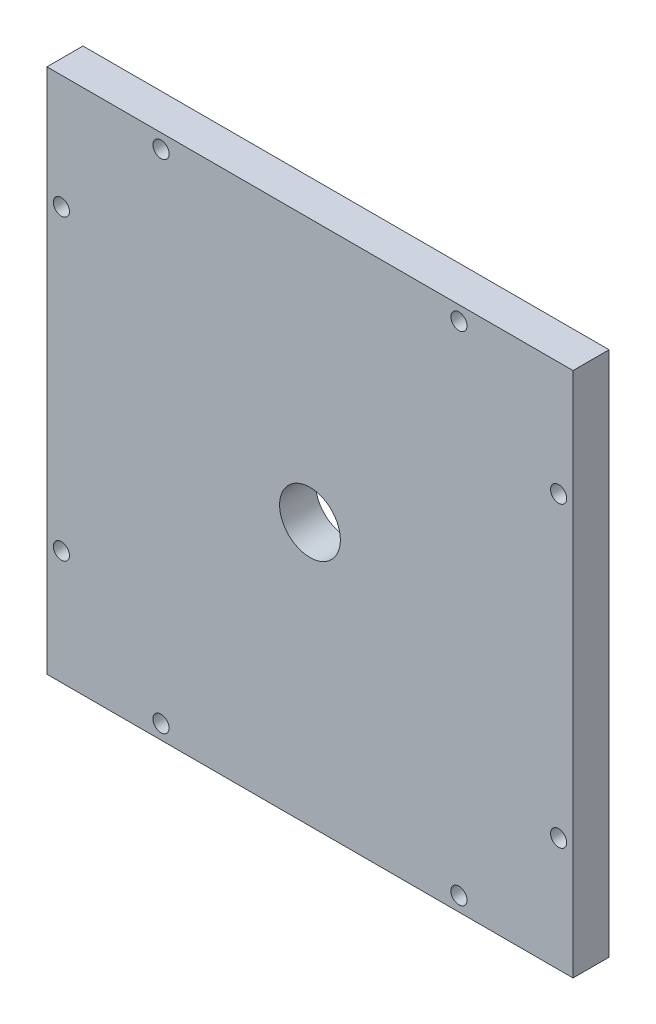
ISO-10303-21;
HEADER;
FILE_DESCRIPTION(('STEP AP214'),'2;1');
FILE_NAME('part.step','',(''),(''),'','','');
FILE_SCHEMA(('AUTOMOTIVE_DESIGN { 1 0 10303 214 1 1 1 1 }'));
ENDSEC;
DATA;
#1=APPLICATION_CONTEXT('core data for automotive mechanical design processes');
#2=APPLICATION_PROTOCOL_DEFINITION('international standard','automotive_design',2000,#1);
#3=PRODUCT_CONTEXT('',#1,'mechanical');
#4=PRODUCT('Part','Part','',(#3));
#5=PRODUCT_RELATED_PRODUCT_CATEGORY('part','',(#4));
#6=PRODUCT_DEFINITION_FORMATION('','',#4);
#7=PRODUCT_DEFINITION_CONTEXT('part definition',#1,'design');
#8=PRODUCT_DEFINITION('design','',#6,#7);
#9=PRODUCT_DEFINITION_SHAPE('','',#8);
#10=(LENGTH_UNIT() NAMED_UNIT(*) SI_UNIT(.MILLI.,.METRE.));
#11=(NAMED_UNIT(*) PLANE_ANGLE_UNIT() SI_UNIT($,.RADIAN.));
#12=(NAMED_UNIT(*) SI_UNIT($,.STERADIAN.) SOLID_ANGLE_UNIT());
#13=UNCERTAINTY_MEASURE_WITH_UNIT(LENGTH_MEASURE(1.E-05),#10,'distance_accuracy_value','');
#14=(GEOMETRIC_REPRESENTATION_CONTEXT(3) GLOBAL_UNCERTAINTY_ASSIGNED_CONTEXT((#13)) GLOBAL_UNIT_ASSIGNED_CONTEXT((#10,
#11,#12)) REPRESENTATION_CONTEXT('',''));
#15=CARTESIAN_POINT('',(0.,0.,0.));
#16=DIRECTION('',(0.,0.,1.));
#17=DIRECTION('',(1.,0.,0.));
#18=AXIS2_PLACEMENT_3D('',#15,#16,#17);
#19=CARTESIAN_POINT('',(0.,0.,6.35));
#20=DIRECTION('',(0.,0.,-1.));
#21=DIRECTION('',(-1.,0.,0.));
#22=AXIS2_PLACEMENT_3D('',#19,#20,#21);
#23=PLANE('',#22);
#24=CARTESIAN_POINT('',(2.54,72.609964,6.35));
#25=DIRECTION('',(0.,0.,1.));
#26=DIRECTION('',(-1.,0.,0.));
#27=AXIS2_PLACEMENT_3D('',#24,#25,#26);
#28=CIRCLE('',#27,1.4224);
#29=CARTESIAN_POINT('',(1.1176,72.609964,6.35));
#30=VERTEX_POINT('',#29);
#31=EDGE_CURVE('E162',#30,#30,#28,.T.);
#32=ORIENTED_EDGE('',*,*,#31,.F.);
#33=EDGE_LOOP('',(#32));
#34=FACE_BOUND('',#33,.T.);
#35=CARTESIAN_POINT('',(20.100036,90.17,6.35));
#36=DIRECTION('',(0.,0.,1.));
#37=DIRECTION('',(1.,0.,0.));
#38=AXIS2_PLACEMENT_3D('',#35,#36,#37);
#39=CIRCLE('',#38,1.4224);
#40=CARTESIAN_POINT('',(21.522436,90.17,6.35));
#41=VERTEX_POINT('',#40);
#42=EDGE_CURVE('E156',#41,#41,#39,.T.);
#43=ORIENTED_EDGE('',*,*,#42,.F.);
#44=EDGE_LOOP('',(#43));
#45=FACE_BOUND('',#44,.T.);
#46=CARTESIAN_POINT('',(72.609964,90.17,6.35));
#47=DIRECTION('',(0.,0.,1.));
#48=DIRECTION('',(-1.,0.,0.));
#49=AXIS2_PLACEMENT_3D('',#46,#47,#48);
#50=CIRCLE('',#49,1.42240000000001);
#51=CARTESIAN_POINT('',(71.187564,90.17,6.35));
#52=VERTEX_POINT('',#51);
#53=EDGE_CURVE('E150',#52,#52,#50,.T.);
#54=ORIENTED_EDGE('',*,*,#53,.F.);
#55=EDGE_LOOP('',(#54));
#56=FACE_BOUND('',#55,.T.);
#57=CARTESIAN_POINT('',(90.17,72.609964,6.35));
#58=DIRECTION('',(0.,0.,1.));
#59=DIRECTION('',(1.,0.,0.));
#60=AXIS2_PLACEMENT_3D('',#57,#58,#59);
#61=CIRCLE('',#60,1.42240000000001);
#62=CARTESIAN_POINT('',(91.5924,72.609964,6.35));
#63=VERTEX_POINT('',#62);
#64=EDGE_CURVE('E144',#63,#63,#61,.T.);
#65=ORIENTED_EDGE('',*,*,#64,.F.);
#66=EDGE_LOOP('',(#65));
#67=FACE_BOUND('',#66,.T.);
#68=CARTESIAN_POINT('',(90.17,20.100036,6.35));
#69=DIRECTION('',(0.,0.,1.));
#70=DIRECTION('',(-1.,0.,0.));
#71=AXIS2_PLACEMENT_3D('',#68,#69,#70);
#72=CIRCLE('',#71,1.42240000000001);
#73=CARTESIAN_POINT('',(88.7476,20.100036,6.35));
#74=VERTEX_POINT('',#73);
#75=EDGE_CURVE('E138',#74,#74,#72,.T.);
#76=ORIENTED_EDGE('',*,*,#75,.F.);
#77=EDGE_LOOP('',(#76));
#78=FACE_BOUND('',#77,.T.);
#79=CARTESIAN_POINT('',(20.100036,2.54,6.35));
#80=DIRECTION('',(0.,0.,1.));
#81=DIRECTION('',(-1.,0.,0.));
#82=AXIS2_PLACEMENT_3D('',#79,#80,#81);
#83=CIRCLE('',#82,1.4224);
#84=CARTESIAN_POINT('',(18.677636,2.54,6.35));
#85=VERTEX_POINT('',#84);
#86=EDGE_CURVE('E132',#85,#85,#83,.T.);
#87=ORIENTED_EDGE('',*,*,#86,.F.);
#88=EDGE_LOOP('',(#87));
#89=FACE_BOUND('',#88,.T.);
#90=CARTESIAN_POINT('',(2.54,20.100036,6.35));
#91=DIRECTION('',(0.,0.,1.));
#92=DIRECTION('',(1.,0.,0.));
#93=AXIS2_PLACEMENT_3D('',#90,#91,#92);
#94=CIRCLE('',#93,1.4224);
#95=CARTESIAN_POINT('',(3.9624,20.100036,6.35));
#96=VERTEX_POINT('',#95);
#97=EDGE_CURVE('E126',#96,#96,#94,.T.);
#98=ORIENTED_EDGE('',*,*,#97,.F.);
#99=EDGE_LOOP('',(#98));
#100=FACE_BOUND('',#99,.T.);
#101=CARTESIAN_POINT('',(72.609964,2.54,6.35));
#102=DIRECTION('',(0.,0.,1.));
#103=DIRECTION('',(1.,0.,0.));
#104=AXIS2_PLACEMENT_3D('',#101,#102,#103);
#105=CIRCLE('',#104,1.42240000000001);
#106=CARTESIAN_POINT('',(74.032364,2.54,6.35));
#107=VERTEX_POINT('',#106);
#108=EDGE_CURVE('E120',#107,#107,#105,.T.);
#109=ORIENTED_EDGE('',*,*,#108,.F.);
#110=EDGE_LOOP('',(#109));
#111=FACE_BOUND('',#110,.T.);
#112=DIRECTION('',(0.,-1.,0.));
#113=VECTOR('',#112,1.);
#114=CARTESIAN_POINT('',(0.,0.,6.35));
#115=LINE('',#114,#113);
#116=CARTESIAN_POINT('',(0.,92.71,6.35));
#117=VERTEX_POINT('',#116);
#118=CARTESIAN_POINT('',(0.,0.,6.35));
#119=VERTEX_POINT('',#118);
#120=EDGE_CURVE('E87',#117,#119,#115,.T.);
#121=ORIENTED_EDGE('',*,*,#120,.T.);
#122=DIRECTION('',(1.,0.,0.));
#123=VECTOR('',#122,1.);
#124=CARTESIAN_POINT('',(0.,0.,6.35));
#125=LINE('',#124,#123);
#126=CARTESIAN_POINT('',(92.71,0.,6.35));
#127=VERTEX_POINT('',#126);
#128=EDGE_CURVE('E82',#119,#127,#125,.T.);
#129=ORIENTED_EDGE('',*,*,#128,.T.);
#130=DIRECTION('',(0.,1.,0.));
#131=VECTOR('',#130,1.);
#132=CARTESIAN_POINT('',(92.71,0.,6.35));
#133=LINE('',#132,#131);
#134=CARTESIAN_POINT('',(92.71,92.71,6.35));
#135=VERTEX_POINT('',#134);
#136=EDGE_CURVE('E85',#127,#135,#133,.T.);
#137=ORIENTED_EDGE('',*,*,#136,.T.);
#138=DIRECTION('',(-1.,0.,0.));
#139=VECTOR('',#138,1.);
#140=CARTESIAN_POINT('',(0.,92.71,6.35));
#141=LINE('',#140,#139);
#142=EDGE_CURVE('E52',#135,#117,#141,.T.);
#143=ORIENTED_EDGE('',*,*,#142,.T.);
#144=EDGE_LOOP('',(#121,#129,#137,#143));
#145=FACE_BOUND('',#144,.T.);
#146=CARTESIAN_POINT('',(46.355,46.355,6.35));
#147=DIRECTION('',(0.,0.,1.));
#148=DIRECTION('',(1.,0.,0.));
#149=AXIS2_PLACEMENT_3D('',#146,#147,#148);
#150=CIRCLE('',#149,5.3578125);
#151=CARTESIAN_POINT('',(51.7128125,46.355,6.35));
#152=VERTEX_POINT('',#151);
#153=EDGE_CURVE('E102',#152,#152,#150,.T.);
#154=ORIENTED_EDGE('',*,*,#153,.F.);
#155=EDGE_LOOP('',(#154));
#156=FACE_BOUND('',#155,.T.);
#157=ADVANCED_FACE('F35',(#34,#45,#56,#67,#78,#89,#100,#111,#145,#156),#23,.F.);
#158=CARTESIAN_POINT('',(0.,0.,0.));
#159=DIRECTION('',(0.,0.,-1.));
#160=DIRECTION('',(-1.,0.,0.));
#161=AXIS2_PLACEMENT_3D('',#158,#159,#160);
#162=PLANE('',#161);
#163=CARTESIAN_POINT('',(2.54,72.609964,0.));
#164=DIRECTION('',(0.,0.,1.));
#165=DIRECTION('',(-1.,0.,0.));
#166=AXIS2_PLACEMENT_3D('',#163,#164,#165);
#167=CIRCLE('',#166,1.4224);
#168=CARTESIAN_POINT('',(1.1176,72.609964,0.));
#169=VERTEX_POINT('',#168);
#170=EDGE_CURVE('E159',#169,#169,#167,.T.);
#171=ORIENTED_EDGE('',*,*,#170,.T.);
#172=EDGE_LOOP('',(#171));
#173=FACE_BOUND('',#172,.T.);
#174=CARTESIAN_POINT('',(20.100036,90.17,0.));
#175=DIRECTION('',(0.,0.,1.));
#176=DIRECTION('',(1.,0.,0.));
#177=AXIS2_PLACEMENT_3D('',#174,#175,#176);
#178=CIRCLE('',#177,1.4224);
#179=CARTESIAN_POINT('',(21.522436,90.17,0.));
#180=VERTEX_POINT('',#179);
#181=EDGE_CURVE('E153',#180,#180,#178,.T.);
#182=ORIENTED_EDGE('',*,*,#181,.T.);
#183=EDGE_LOOP('',(#182));
#184=FACE_BOUND('',#183,.T.);
#185=CARTESIAN_POINT('',(72.609964,90.17,0.));
#186=DIRECTION('',(0.,0.,1.));
#187=DIRECTION('',(-1.,0.,0.));
#188=AXIS2_PLACEMENT_3D('',#185,#186,#187);
#189=CIRCLE('',#188,1.42240000000001);
#190=CARTESIAN_POINT('',(71.187564,90.17,0.));
#191=VERTEX_POINT('',#190);
#192=EDGE_CURVE('E147',#191,#191,#189,.T.);
#193=ORIENTED_EDGE('',*,*,#192,.T.);
#194=EDGE_LOOP('',(#193));
#195=FACE_BOUND('',#194,.T.);
#196=CARTESIAN_POINT('',(90.17,72.609964,0.));
#197=DIRECTION('',(0.,0.,1.));
#198=DIRECTION('',(1.,0.,0.));
#199=AXIS2_PLACEMENT_3D('',#196,#197,#198);
#200=CIRCLE('',#199,1.42240000000001);
#201=CARTESIAN_POINT('',(91.5924,72.609964,0.));
#202=VERTEX_POINT('',#201);
#203=EDGE_CURVE('E141',#202,#202,#200,.T.);
#204=ORIENTED_EDGE('',*,*,#203,.T.);
#205=EDGE_LOOP('',(#204));
#206=FACE_BOUND('',#205,.T.);
#207=CARTESIAN_POINT('',(90.17,20.100036,0.));
#208=DIRECTION('',(0.,0.,1.));
#209=DIRECTION('',(-1.,0.,0.));
#210=AXIS2_PLACEMENT_3D('',#207,#208,#209);
#211=CIRCLE('',#210,1.42240000000001);
#212=CARTESIAN_POINT('',(88.7476,20.100036,0.));
#213=VERTEX_POINT('',#212);
#214=EDGE_CURVE('E135',#213,#213,#211,.T.);
#215=ORIENTED_EDGE('',*,*,#214,.T.);
#216=EDGE_LOOP('',(#215));
#217=FACE_BOUND('',#216,.T.);
#218=CARTESIAN_POINT('',(20.100036,2.54,0.));
#219=DIRECTION('',(0.,0.,1.));
#220=DIRECTION('',(-1.,0.,0.));
#221=AXIS2_PLACEMENT_3D('',#218,#219,#220);
#222=CIRCLE('',#221,1.4224);
#223=CARTESIAN_POINT('',(18.677636,2.54,0.));
#224=VERTEX_POINT('',#223);
#225=EDGE_CURVE('E129',#224,#224,#222,.T.);
#226=ORIENTED_EDGE('',*,*,#225,.T.);
#227=EDGE_LOOP('',(#226));
#228=FACE_BOUND('',#227,.T.);
#229=CARTESIAN_POINT('',(2.54,20.100036,0.));
#230=DIRECTION('',(0.,0.,1.));
#231=DIRECTION('',(1.,0.,0.));
#232=AXIS2_PLACEMENT_3D('',#229,#230,#231);
#233=CIRCLE('',#232,1.4224);
#234=CARTESIAN_POINT('',(3.9624,20.100036,0.));
#235=VERTEX_POINT('',#234);
#236=EDGE_CURVE('E123',#235,#235,#233,.T.);
#237=ORIENTED_EDGE('',*,*,#236,.T.);
#238=EDGE_LOOP('',(#237));
#239=FACE_BOUND('',#238,.T.);
#240=CARTESIAN_POINT('',(72.609964,2.54,0.));
#241=DIRECTION('',(0.,0.,1.));
#242=DIRECTION('',(1.,0.,0.));
#243=AXIS2_PLACEMENT_3D('',#240,#241,#242);
#244=CIRCLE('',#243,1.42240000000001);
#245=CARTESIAN_POINT('',(74.032364,2.54,0.));
#246=VERTEX_POINT('',#245);
#247=EDGE_CURVE('E117',#246,#246,#244,.T.);
#248=ORIENTED_EDGE('',*,*,#247,.T.);
#249=EDGE_LOOP('',(#248));
#250=FACE_BOUND('',#249,.T.);
#251=DIRECTION('',(0.,-1.,0.));
#252=VECTOR('',#251,1.);
#253=CARTESIAN_POINT('',(0.,0.,0.));
#254=LINE('',#253,#252);
#255=CARTESIAN_POINT('',(0.,92.71,0.));
#256=VERTEX_POINT('',#255);
#257=CARTESIAN_POINT('',(0.,0.,0.));
#258=VERTEX_POINT('',#257);
#259=EDGE_CURVE('E99',#256,#258,#254,.T.);
#260=ORIENTED_EDGE('',*,*,#259,.F.);
#261=DIRECTION('',(-1.,0.,0.));
#262=VECTOR('',#261,1.);
#263=CARTESIAN_POINT('',(0.,92.71,0.));
#264=LINE('',#263,#262);
#265=CARTESIAN_POINT('',(92.71,92.71,0.));
#266=VERTEX_POINT('',#265);
#267=EDGE_CURVE('E75',#266,#256,#264,.T.);
#268=ORIENTED_EDGE('',*,*,#267,.F.);
#269=DIRECTION('',(0.,1.,0.));
#270=VECTOR('',#269,1.);
#271=CARTESIAN_POINT('',(92.71,0.,0.));
#272=LINE('',#271,#270);
#273=CARTESIAN_POINT('',(92.71,0.,0.));
#274=VERTEX_POINT('',#273);
#275=EDGE_CURVE('E69',#274,#266,#272,.T.);
#276=ORIENTED_EDGE('',*,*,#275,.F.);
#277=DIRECTION('',(1.,0.,0.));
#278=VECTOR('',#277,1.);
#279=CARTESIAN_POINT('',(0.,0.,0.));
#280=LINE('',#279,#278);
#281=EDGE_CURVE('E91',#258,#274,#280,.T.);
#282=ORIENTED_EDGE('',*,*,#281,.F.);
#283=EDGE_LOOP('',(#260,#268,#276,#282));
#284=FACE_BOUND('',#283,.T.);
#285=CARTESIAN_POINT('',(46.355,46.355,0.));
#286=DIRECTION('',(0.,0.,1.));
#287=DIRECTION('',(1.,0.,0.));
#288=AXIS2_PLACEMENT_3D('',#285,#286,#287);
#289=CIRCLE('',#288,5.3578125);
#290=CARTESIAN_POINT('',(51.7128125,46.355,0.));
#291=VERTEX_POINT('',#290);
#292=EDGE_CURVE('E114',#291,#291,#289,.T.);
#293=ORIENTED_EDGE('',*,*,#292,.T.);
#294=EDGE_LOOP('',(#293));
#295=FACE_BOUND('',#294,.T.);
#296=ADVANCED_FACE('F110',(#173,#184,#195,#206,#217,#228,#239,#250,#284,#295),#162,.T.);
#297=CARTESIAN_POINT('',(0.,0.,6.35));
#298=DIRECTION('',(1.,0.,0.));
#299=DIRECTION('',(0.,1.,0.));
#300=AXIS2_PLACEMENT_3D('',#297,#298,#299);
#301=PLANE('',#300);
#302=ORIENTED_EDGE('',*,*,#259,.T.);
#303=DIRECTION('',(0.,0.,-1.));
#304=VECTOR('',#303,1.);
#305=CARTESIAN_POINT('',(0.,0.,6.35));
#306=LINE('',#305,#304);
#307=EDGE_CURVE('E11',#119,#258,#306,.T.);
#308=ORIENTED_EDGE('',*,*,#307,.F.);
#309=ORIENTED_EDGE('',*,*,#120,.F.);
#310=DIRECTION('',(0.,0.,-1.));
#311=VECTOR('',#310,1.);
#312=CARTESIAN_POINT('',(0.,92.71,6.35));
#313=LINE('',#312,#311);
#314=EDGE_CURVE('E95',#117,#256,#313,.T.);
#315=ORIENTED_EDGE('',*,*,#314,.T.);
#316=EDGE_LOOP('',(#302,#308,#309,#315));
#317=FACE_BOUND('',#316,.T.);
#318=ADVANCED_FACE('F37',(#317),#301,.F.);
#319=CARTESIAN_POINT('',(0.,0.,6.35));
#320=DIRECTION('',(0.,1.,0.));
#321=DIRECTION('',(-1.,0.,0.));
#322=AXIS2_PLACEMENT_3D('',#319,#320,#321);
#323=PLANE('',#322);
#324=ORIENTED_EDGE('',*,*,#281,.T.);
#325=DIRECTION('',(0.,0.,-1.));
#326=VECTOR('',#325,1.);
#327=CARTESIAN_POINT('',(92.71,0.,6.35));
#328=LINE('',#327,#326);
#329=EDGE_CURVE('E44',#127,#274,#328,.T.);
#330=ORIENTED_EDGE('',*,*,#329,.F.);
#331=ORIENTED_EDGE('',*,*,#128,.F.);
#332=ORIENTED_EDGE('',*,*,#307,.T.);
#333=EDGE_LOOP('',(#324,#330,#331,#332));
#334=FACE_BOUND('',#333,.T.);
#335=ADVANCED_FACE('F90',(#334),#323,.F.);
#336=CARTESIAN_POINT('',(92.71,0.,6.35));
#337=DIRECTION('',(-1.,0.,0.));
#338=DIRECTION('',(0.,0.,1.));
#339=AXIS2_PLACEMENT_3D('',#336,#337,#338);
#340=PLANE('',#339);
#341=ORIENTED_EDGE('',*,*,#275,.T.);
#342=DIRECTION('',(0.,0.,-1.));
#343=VECTOR('',#342,1.);
#344=CARTESIAN_POINT('',(92.71,92.71,6.35));
#345=LINE('',#344,#343);
#346=EDGE_CURVE('E92',#135,#266,#345,.T.);
#347=ORIENTED_EDGE('',*,*,#346,.F.);
#348=ORIENTED_EDGE('',*,*,#136,.F.);
#349=ORIENTED_EDGE('',*,*,#329,.T.);
#350=EDGE_LOOP('',(#341,#347,#348,#349));
#351=FACE_BOUND('',#350,.T.);
#352=ADVANCED_FACE('F93',(#351),#340,.F.);
#353=CARTESIAN_POINT('',(0.,92.71,6.35));
#354=DIRECTION('',(0.,-1.,0.));
#355=DIRECTION('',(1.,0.,0.));
#356=AXIS2_PLACEMENT_3D('',#353,#354,#355);
#357=PLANE('',#356);
#358=ORIENTED_EDGE('',*,*,#267,.T.);
#359=ORIENTED_EDGE('',*,*,#314,.F.);
#360=ORIENTED_EDGE('',*,*,#142,.F.);
#361=ORIENTED_EDGE('',*,*,#346,.T.);
#362=EDGE_LOOP('',(#358,#359,#360,#361));
#363=FACE_BOUND('',#362,.T.);
#364=ADVANCED_FACE('F107',(#363),#357,.F.);
#365=CARTESIAN_POINT('',(46.355,46.355,6.35));
#366=DIRECTION('',(0.,0.,-1.));
#367=DIRECTION('',(-1.,0.,0.));
#368=AXIS2_PLACEMENT_3D('',#365,#366,#367);
#369=CYLINDRICAL_SURFACE('',#368,5.3578125);
#370=ORIENTED_EDGE('',*,*,#153,.T.);
#371=EDGE_LOOP('',(#370));
#372=FACE_BOUND('',#371,.T.);
#373=ORIENTED_EDGE('',*,*,#292,.F.);
#374=EDGE_LOOP('',(#373));
#375=FACE_BOUND('',#374,.T.);
#376=ADVANCED_FACE('F197',(#372,#375),#369,.F.);
#377=CARTESIAN_POINT('',(72.609964,2.54,0.));
#378=DIRECTION('',(0.,0.,1.));
#379=DIRECTION('',(1.,0.,0.));
#380=AXIS2_PLACEMENT_3D('',#377,#378,#379);
#381=CYLINDRICAL_SURFACE('',#380,1.42240000000001);
#382=ORIENTED_EDGE('',*,*,#247,.F.);
#383=EDGE_LOOP('',(#382));
#384=FACE_BOUND('',#383,.T.);
#385=ORIENTED_EDGE('',*,*,#108,.T.);
#386=EDGE_LOOP('',(#385));
#387=FACE_BOUND('',#386,.T.);
#388=ADVANCED_FACE('F194',(#384,#387),#381,.F.);
#389=CARTESIAN_POINT('',(2.54,20.100036,0.));
#390=DIRECTION('',(0.,0.,1.));
#391=DIRECTION('',(1.,0.,0.));
#392=AXIS2_PLACEMENT_3D('',#389,#390,#391);
#393=CYLINDRICAL_SURFACE('',#392,1.4224);
#394=ORIENTED_EDGE('',*,*,#236,.F.);
#395=EDGE_LOOP('',(#394));
#396=FACE_BOUND('',#395,.T.);
#397=ORIENTED_EDGE('',*,*,#97,.T.);
#398=EDGE_LOOP('',(#397));
#399=FACE_BOUND('',#398,.T.);
#400=ADVANCED_FACE('F196',(#396,#399),#393,.F.);
#401=CARTESIAN_POINT('',(20.100036,2.54,0.));
#402=DIRECTION('',(0.,0.,1.));
#403=DIRECTION('',(1.,0.,0.));
#404=AXIS2_PLACEMENT_3D('',#401,#402,#403);
#405=CYLINDRICAL_SURFACE('',#404,1.4224);
#406=ORIENTED_EDGE('',*,*,#225,.F.);
#407=EDGE_LOOP('',(#406));
#408=FACE_BOUND('',#407,.T.);
#409=ORIENTED_EDGE('',*,*,#86,.T.);
#410=EDGE_LOOP('',(#409));
#411=FACE_BOUND('',#410,.T.);
#412=ADVANCED_FACE('F204',(#408,#411),#405,.F.);
#413=CARTESIAN_POINT('',(90.17,20.100036,0.));
#414=DIRECTION('',(0.,0.,1.));
#415=DIRECTION('',(1.,0.,0.));
#416=AXIS2_PLACEMENT_3D('',#413,#414,#415);
#417=CYLINDRICAL_SURFACE('',#416,1.42240000000001);
#418=ORIENTED_EDGE('',*,*,#214,.F.);
#419=EDGE_LOOP('',(#418));
#420=FACE_BOUND('',#419,.T.);
#421=ORIENTED_EDGE('',*,*,#75,.T.);
#422=EDGE_LOOP('',(#421));
#423=FACE_BOUND('',#422,.T.);
#424=ADVANCED_FACE('F276',(#420,#423),#417,.F.);
#425=CARTESIAN_POINT('',(90.17,72.609964,0.));
#426=DIRECTION('',(0.,0.,1.));
#427=DIRECTION('',(1.,0.,0.));
#428=AXIS2_PLACEMENT_3D('',#425,#426,#427);
#429=CYLINDRICAL_SURFACE('',#428,1.42240000000001);
#430=ORIENTED_EDGE('',*,*,#203,.F.);
#431=EDGE_LOOP('',(#430));
#432=FACE_BOUND('',#431,.T.);
#433=ORIENTED_EDGE('',*,*,#64,.T.);
#434=EDGE_LOOP('',(#433));
#435=FACE_BOUND('',#434,.T.);
#436=ADVANCED_FACE('F284',(#432,#435),#429,.F.);
#437=CARTESIAN_POINT('',(72.609964,90.17,0.));
#438=DIRECTION('',(0.,0.,1.));
#439=DIRECTION('',(1.,0.,0.));
#440=AXIS2_PLACEMENT_3D('',#437,#438,#439);
#441=CYLINDRICAL_SURFACE('',#440,1.42240000000001);
#442=ORIENTED_EDGE('',*,*,#192,.F.);
#443=EDGE_LOOP('',(#442));
#444=FACE_BOUND('',#443,.T.);
#445=ORIENTED_EDGE('',*,*,#53,.T.);
#446=EDGE_LOOP('',(#445));
#447=FACE_BOUND('',#446,.T.);
#448=ADVANCED_FACE('F293',(#444,#447),#441,.F.);
#449=CARTESIAN_POINT('',(20.100036,90.17,0.));
#450=DIRECTION('',(0.,0.,1.));
#451=DIRECTION('',(1.,0.,0.));
#452=AXIS2_PLACEMENT_3D('',#449,#450,#451);
#453=CYLINDRICAL_SURFACE('',#452,1.4224);
#454=ORIENTED_EDGE('',*,*,#181,.F.);
#455=EDGE_LOOP('',(#454));
#456=FACE_BOUND('',#455,.T.);
#457=ORIENTED_EDGE('',*,*,#42,.T.);
#458=EDGE_LOOP('',(#457));
#459=FACE_BOUND('',#458,.T.);
#460=ADVANCED_FACE('F173',(#456,#459),#453,.F.);
#461=CARTESIAN_POINT('',(2.54,72.609964,0.));
#462=DIRECTION('',(0.,0.,1.));
#463=DIRECTION('',(1.,0.,0.));
#464=AXIS2_PLACEMENT_3D('',#461,#462,#463);
#465=CYLINDRICAL_SURFACE('',#464,1.4224);
#466=ORIENTED_EDGE('',*,*,#170,.F.);
#467=EDGE_LOOP('',(#466));
#468=FACE_BOUND('',#467,.T.);
#469=ORIENTED_EDGE('',*,*,#31,.T.);
#470=EDGE_LOOP('',(#469));
#471=FACE_BOUND('',#470,.T.);
#472=ADVANCED_FACE('F170',(#468,#471),#465,.F.);
#473=CLOSED_SHELL('',(#157,#296,#318,#335,#352,#364,#376,#388,#400,#412,#424,#436,#448,#460,#472));
#474=MANIFOLD_SOLID_BREP('B2',#473);
#475=ADVANCED_BREP_SHAPE_REPRESENTATION('',(#18,#474),#14);
#476=SHAPE_DEFINITION_REPRESENTATION(#9,#475);
ENDSEC;
END-ISO-10303-21;
